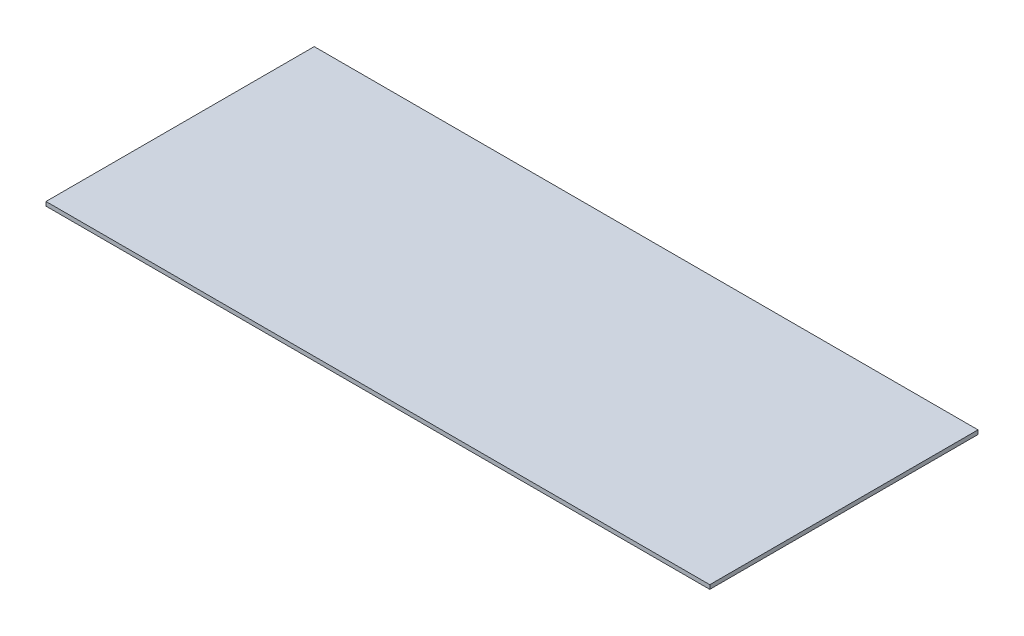
ISO-10303-21;
HEADER;
FILE_DESCRIPTION(('STEP AP214'),'2;1');
FILE_NAME('part.step','',(''),(''),'','','');
FILE_SCHEMA(('AUTOMOTIVE_DESIGN { 1 0 10303 214 1 1 1 1 }'));
ENDSEC;
DATA;
#1=APPLICATION_CONTEXT('core data for automotive mechanical design processes');
#2=APPLICATION_PROTOCOL_DEFINITION('international standard','automotive_design',2000,#1);
#3=PRODUCT_CONTEXT('',#1,'mechanical');
#4=PRODUCT('Part','Part','',(#3));
#5=PRODUCT_RELATED_PRODUCT_CATEGORY('part','',(#4));
#6=PRODUCT_DEFINITION_FORMATION('','',#4);
#7=PRODUCT_DEFINITION_CONTEXT('part definition',#1,'design');
#8=PRODUCT_DEFINITION('design','',#6,#7);
#9=PRODUCT_DEFINITION_SHAPE('','',#8);
#10=(LENGTH_UNIT() NAMED_UNIT(*) SI_UNIT(.MILLI.,.METRE.));
#11=(NAMED_UNIT(*) PLANE_ANGLE_UNIT() SI_UNIT($,.RADIAN.));
#12=(NAMED_UNIT(*) SI_UNIT($,.STERADIAN.) SOLID_ANGLE_UNIT());
#13=UNCERTAINTY_MEASURE_WITH_UNIT(LENGTH_MEASURE(1.E-05),#10,'distance_accuracy_value','');
#14=(GEOMETRIC_REPRESENTATION_CONTEXT(3) GLOBAL_UNCERTAINTY_ASSIGNED_CONTEXT((#13)) GLOBAL_UNIT_ASSIGNED_CONTEXT((#10,
#11,#12)) REPRESENTATION_CONTEXT('',''));
#15=CARTESIAN_POINT('',(0.,0.,0.));
#16=DIRECTION('',(0.,0.,1.));
#17=DIRECTION('',(1.,0.,0.));
#18=AXIS2_PLACEMENT_3D('',#15,#16,#17);
#19=CARTESIAN_POINT('',(-1.26509109647714,54.2761410926052,-1.26509109647716));
#20=DIRECTION('',(1.,0.,0.));
#21=DIRECTION('',(0.,0.,-1.));
#22=AXIS2_PLACEMENT_3D('',#19,#20,#21);
#23=PLANE('',#22);
#24=DIRECTION('',(0.,0.,-1.));
#25=VECTOR('',#24,1.);
#26=CARTESIAN_POINT('',(-1.26509109647714,54.999,-1.26509109647716));
#27=LINE('',#26,#25);
#28=CARTESIAN_POINT('',(-1.26509109647714,54.999,-1.26509109647716));
#29=VERTEX_POINT('',#28);
#30=CARTESIAN_POINT('',(-1.26509109647716,54.999,-48.7349089035229));
#31=VERTEX_POINT('',#30);
#32=EDGE_CURVE('E79',#29,#31,#27,.T.);
#33=ORIENTED_EDGE('',*,*,#32,.F.);
#34=DIRECTION('',(0.,1.,0.));
#35=VECTOR('',#34,1.);
#36=CARTESIAN_POINT('',(-1.26509109647714,54.2761410926052,-1.26509109647716));
#37=LINE('',#36,#35);
#38=CARTESIAN_POINT('',(-1.26509109647714,54.2761410926052,-1.26509109647716));
#39=VERTEX_POINT('',#38);
#40=EDGE_CURVE('E32',#39,#29,#37,.T.);
#41=ORIENTED_EDGE('',*,*,#40,.F.);
#42=DIRECTION('',(0.,0.,-1.));
#43=VECTOR('',#42,1.);
#44=CARTESIAN_POINT('',(-1.26509109647714,54.2761410926052,-1.26509109647716));
#45=LINE('',#44,#43);
#46=CARTESIAN_POINT('',(-1.26509109647716,54.2761410926052,-48.7349089035229));
#47=VERTEX_POINT('',#46);
#48=EDGE_CURVE('E71',#39,#47,#45,.T.);
#49=ORIENTED_EDGE('',*,*,#48,.T.);
#50=DIRECTION('',(0.,1.,0.));
#51=VECTOR('',#50,1.);
#52=CARTESIAN_POINT('',(-1.26509109647716,54.2761410926052,-48.7349089035229));
#53=LINE('',#52,#51);
#54=EDGE_CURVE('E10',#47,#31,#53,.T.);
#55=ORIENTED_EDGE('',*,*,#54,.T.);
#56=EDGE_LOOP('',(#33,#41,#49,#55));
#57=FACE_BOUND('',#56,.T.);
#58=ADVANCED_FACE('F16',(#57),#23,.T.);
#59=CARTESIAN_POINT('',(-1.26509109647716,54.2761410926052,-48.7349089035229));
#60=DIRECTION('',(0.,0.,-1.));
#61=DIRECTION('',(0.,1.,0.));
#62=AXIS2_PLACEMENT_3D('',#59,#60,#61);
#63=PLANE('',#62);
#64=DIRECTION('',(-1.,0.,0.));
#65=VECTOR('',#64,1.);
#66=CARTESIAN_POINT('',(-1.26509109647716,54.999,-48.7349089035229));
#67=LINE('',#66,#65);
#68=CARTESIAN_POINT('',(-118.734908903523,54.999,-48.7349089035228));
#69=VERTEX_POINT('',#68);
#70=EDGE_CURVE('E82',#31,#69,#67,.T.);
#71=ORIENTED_EDGE('',*,*,#70,.F.);
#72=ORIENTED_EDGE('',*,*,#54,.F.);
#73=DIRECTION('',(-1.,0.,0.));
#74=VECTOR('',#73,1.);
#75=CARTESIAN_POINT('',(-1.26509109647716,54.2761410926052,-48.7349089035229));
#76=LINE('',#75,#74);
#77=CARTESIAN_POINT('',(-118.734908903523,54.2761410926052,-48.7349089035228));
#78=VERTEX_POINT('',#77);
#79=EDGE_CURVE('E67',#47,#78,#76,.T.);
#80=ORIENTED_EDGE('',*,*,#79,.T.);
#81=DIRECTION('',(0.,1.,0.));
#82=VECTOR('',#81,1.);
#83=CARTESIAN_POINT('',(-118.734908903523,54.2761410926052,-48.7349089035228));
#84=LINE('',#83,#82);
#85=EDGE_CURVE('E24',#78,#69,#84,.T.);
#86=ORIENTED_EDGE('',*,*,#85,.T.);
#87=EDGE_LOOP('',(#71,#72,#80,#86));
#88=FACE_BOUND('',#87,.T.);
#89=ADVANCED_FACE('F68',(#88),#63,.T.);
#90=CARTESIAN_POINT('',(-118.734908903523,54.2761410926052,-48.7349089035228));
#91=DIRECTION('',(-1.,0.,0.));
#92=DIRECTION('',(0.,0.,1.));
#93=AXIS2_PLACEMENT_3D('',#90,#91,#92);
#94=PLANE('',#93);
#95=DIRECTION('',(0.,0.,1.));
#96=VECTOR('',#95,1.);
#97=CARTESIAN_POINT('',(-118.734908903523,54.999,-48.7349089035228));
#98=LINE('',#97,#96);
#99=CARTESIAN_POINT('',(-118.734908903523,54.999,-1.26509109647717));
#100=VERTEX_POINT('',#99);
#101=EDGE_CURVE('E65',#69,#100,#98,.T.);
#102=ORIENTED_EDGE('',*,*,#101,.F.);
#103=ORIENTED_EDGE('',*,*,#85,.F.);
#104=DIRECTION('',(0.,0.,1.));
#105=VECTOR('',#104,1.);
#106=CARTESIAN_POINT('',(-118.734908903523,54.2761410926052,-48.7349089035228));
#107=LINE('',#106,#105);
#108=CARTESIAN_POINT('',(-118.734908903523,54.2761410926052,-1.26509109647717));
#109=VERTEX_POINT('',#108);
#110=EDGE_CURVE('E62',#78,#109,#107,.T.);
#111=ORIENTED_EDGE('',*,*,#110,.T.);
#112=DIRECTION('',(0.,1.,0.));
#113=VECTOR('',#112,1.);
#114=CARTESIAN_POINT('',(-118.734908903523,54.2761410926052,-1.26509109647717));
#115=LINE('',#114,#113);
#116=EDGE_CURVE('E48',#109,#100,#115,.T.);
#117=ORIENTED_EDGE('',*,*,#116,.T.);
#118=EDGE_LOOP('',(#102,#103,#111,#117));
#119=FACE_BOUND('',#118,.T.);
#120=ADVANCED_FACE('F60',(#119),#94,.T.);
#121=CARTESIAN_POINT('',(-118.734908903523,54.2761410926052,-1.26509109647717));
#122=DIRECTION('',(0.,0.,1.));
#123=DIRECTION('',(0.,-1.,0.));
#124=AXIS2_PLACEMENT_3D('',#121,#122,#123);
#125=PLANE('',#124);
#126=DIRECTION('',(1.,0.,0.));
#127=VECTOR('',#126,1.);
#128=CARTESIAN_POINT('',(-118.734908903523,54.999,-1.26509109647717));
#129=LINE('',#128,#127);
#130=EDGE_CURVE('E85',#100,#29,#129,.T.);
#131=ORIENTED_EDGE('',*,*,#130,.F.);
#132=ORIENTED_EDGE('',*,*,#116,.F.);
#133=DIRECTION('',(1.,0.,0.));
#134=VECTOR('',#133,1.);
#135=CARTESIAN_POINT('',(-118.734908903523,54.2761410926052,-1.26509109647717));
#136=LINE('',#135,#134);
#137=EDGE_CURVE('E74',#109,#39,#136,.T.);
#138=ORIENTED_EDGE('',*,*,#137,.T.);
#139=ORIENTED_EDGE('',*,*,#40,.T.);
#140=EDGE_LOOP('',(#131,#132,#138,#139));
#141=FACE_BOUND('',#140,.T.);
#142=ADVANCED_FACE('F96',(#141),#125,.T.);
#143=CARTESIAN_POINT('',(-60.,54.2761410926052,-47.5));
#144=DIRECTION('',(0.,1.,0.));
#145=DIRECTION('',(-1.,0.,0.));
#146=AXIS2_PLACEMENT_3D('',#143,#144,#145);
#147=PLANE('',#146);
#148=ORIENTED_EDGE('',*,*,#48,.F.);
#149=ORIENTED_EDGE('',*,*,#137,.F.);
#150=ORIENTED_EDGE('',*,*,#110,.F.);
#151=ORIENTED_EDGE('',*,*,#79,.F.);
#152=EDGE_LOOP('',(#148,#149,#150,#151));
#153=FACE_BOUND('',#152,.T.);
#154=ADVANCED_FACE('F73',(#153),#147,.F.);
#155=CARTESIAN_POINT('',(-60.,54.999,-47.5));
#156=DIRECTION('',(0.,1.,0.));
#157=DIRECTION('',(-1.,0.,0.));
#158=AXIS2_PLACEMENT_3D('',#155,#156,#157);
#159=PLANE('',#158);
#160=ORIENTED_EDGE('',*,*,#32,.T.);
#161=ORIENTED_EDGE('',*,*,#70,.T.);
#162=ORIENTED_EDGE('',*,*,#101,.T.);
#163=ORIENTED_EDGE('',*,*,#130,.T.);
#164=EDGE_LOOP('',(#160,#161,#162,#163));
#165=FACE_BOUND('',#164,.T.);
#166=ADVANCED_FACE('F89',(#165),#159,.T.);
#167=CLOSED_SHELL('',(#58,#89,#120,#142,#154,#166));
#168=MANIFOLD_SOLID_BREP('B1',#167);
#169=ADVANCED_BREP_SHAPE_REPRESENTATION('',(#18,#168),#14);
#170=SHAPE_DEFINITION_REPRESENTATION(#9,#169);
ENDSEC;
END-ISO-10303-21;
